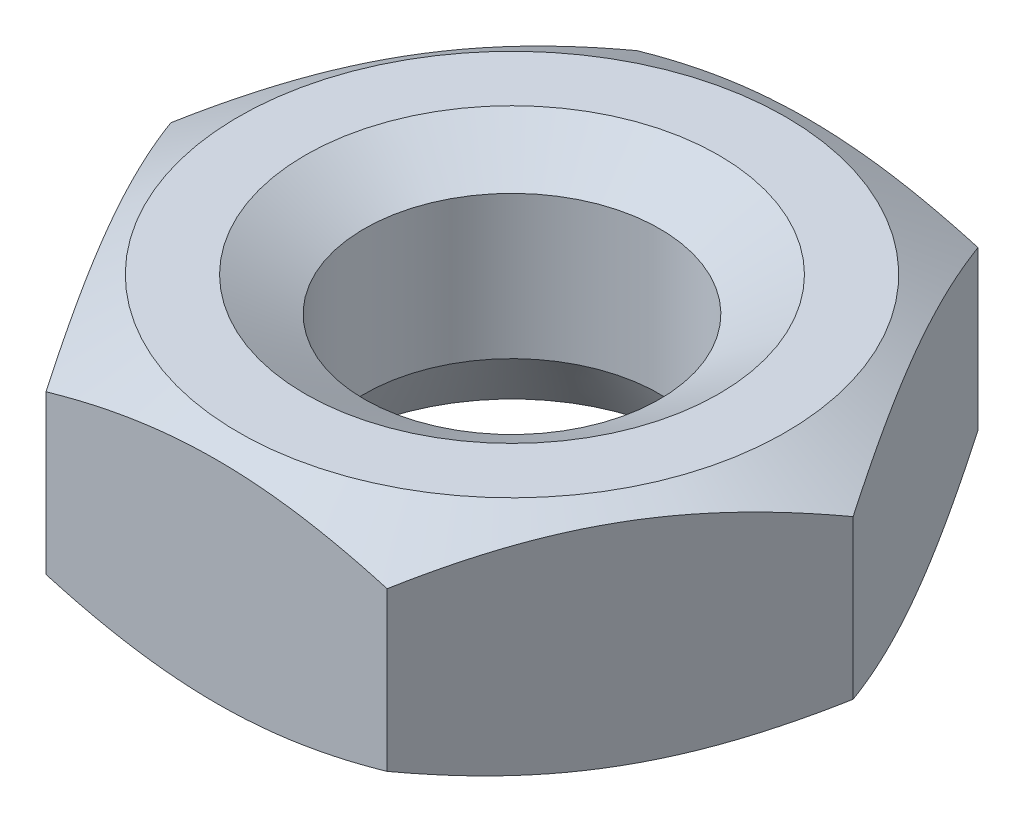
ISO-10303-21;
HEADER;
FILE_DESCRIPTION(('STEP AP214'),'2;1');
FILE_NAME('part.step','',(''),(''),'','','');
FILE_SCHEMA(('AUTOMOTIVE_DESIGN { 1 0 10303 214 1 1 1 1 }'));
ENDSEC;
DATA;
#1=APPLICATION_CONTEXT('core data for automotive mechanical design processes');
#2=APPLICATION_PROTOCOL_DEFINITION('international standard','automotive_design',2000,#1);
#3=PRODUCT_CONTEXT('',#1,'mechanical');
#4=PRODUCT('Part','Part','',(#3));
#5=PRODUCT_RELATED_PRODUCT_CATEGORY('part','',(#4));
#6=PRODUCT_DEFINITION_FORMATION('','',#4);
#7=PRODUCT_DEFINITION_CONTEXT('part definition',#1,'design');
#8=PRODUCT_DEFINITION('design','',#6,#7);
#9=PRODUCT_DEFINITION_SHAPE('','',#8);
#10=(LENGTH_UNIT() NAMED_UNIT(*) SI_UNIT(.MILLI.,.METRE.));
#11=(NAMED_UNIT(*) PLANE_ANGLE_UNIT() SI_UNIT($,.RADIAN.));
#12=(NAMED_UNIT(*) SI_UNIT($,.STERADIAN.) SOLID_ANGLE_UNIT());
#13=UNCERTAINTY_MEASURE_WITH_UNIT(LENGTH_MEASURE(1.E-05),#10,'distance_accuracy_value','');
#14=(GEOMETRIC_REPRESENTATION_CONTEXT(3) GLOBAL_UNCERTAINTY_ASSIGNED_CONTEXT((#13)) GLOBAL_UNIT_ASSIGNED_CONTEXT((#10,
#11,#12)) REPRESENTATION_CONTEXT('',''));
#15=CARTESIAN_POINT('',(0.,0.,0.));
#16=DIRECTION('',(0.,0.,1.));
#17=DIRECTION('',(1.,0.,0.));
#18=AXIS2_PLACEMENT_3D('',#15,#16,#17);
#19=CARTESIAN_POINT('',(-1.38777878078145E-12,4.,-1.08940634291343E-12));
#20=DIRECTION('',(0.,1.,0.));
#21=DIRECTION('',(0.,0.,0.999999999999889));
#22=AXIS2_PLACEMENT_3D('',#19,#20,#21);
#23=PLANE('',#22);
#24=CARTESIAN_POINT('',(-1.38777878078145E-12,4.,-1.08940634291343E-12));
#25=DIRECTION('',(0.,1.,0.));
#26=DIRECTION('',(0.,0.,0.999999999999889));
#27=AXIS2_PLACEMENT_3D('',#24,#25,#26);
#28=CIRCLE('',#27,3.50000000000001);
#29=CARTESIAN_POINT('',(-1.38700162466421E-12,4.,3.49999999999853));
#30=VERTEX_POINT('',#29);
#31=EDGE_CURVE('E108',#30,#30,#28,.F.);
#32=ORIENTED_EDGE('',*,*,#31,.T.);
#33=EDGE_LOOP('',(#32));
#34=FACE_BOUND('',#33,.T.);
#35=CARTESIAN_POINT('',(-1.38777878078145E-12,4.,-1.08940634291343E-12));
#36=DIRECTION('',(0.,-1.,0.));
#37=DIRECTION('',(0.,0.,-0.999999999999889));
#38=AXIS2_PLACEMENT_3D('',#35,#36,#37);
#39=CIRCLE('',#38,4.62815384012406);
#40=CARTESIAN_POINT('',(-1.38880643737241E-12,4.,-4.62815384012464));
#41=VERTEX_POINT('',#40);
#42=EDGE_CURVE('E117',#41,#41,#39,.T.);
#43=ORIENTED_EDGE('',*,*,#42,.F.);
#44=EDGE_LOOP('',(#43));
#45=FACE_BOUND('',#44,.T.);
#46=ADVANCED_FACE('F46',(#34,#45),#23,.T.);
#47=CARTESIAN_POINT('',(0.,0.,0.));
#48=DIRECTION('',(0.,1.,0.));
#49=DIRECTION('',(0.,0.,0.999999999999889));
#50=AXIS2_PLACEMENT_3D('',#47,#48,#49);
#51=PLANE('',#50);
#52=CARTESIAN_POINT('',(0.,0.,0.));
#53=DIRECTION('',(0.,1.,0.));
#54=DIRECTION('',(0.,0.,0.999999999999889));
#55=AXIS2_PLACEMENT_3D('',#52,#53,#54);
#56=CIRCLE('',#55,3.07735026918963);
#57=CARTESIAN_POINT('',(0.,0.,3.07735026918929));
#58=VERTEX_POINT('',#57);
#59=EDGE_CURVE('E136',#58,#58,#56,.T.);
#60=ORIENTED_EDGE('',*,*,#59,.T.);
#61=EDGE_LOOP('',(#60));
#62=FACE_BOUND('',#61,.T.);
#63=CARTESIAN_POINT('',(0.,0.,0.));
#64=DIRECTION('',(0.,-1.,0.));
#65=DIRECTION('',(0.,0.,-0.999999999999889));
#66=AXIS2_PLACEMENT_3D('',#63,#64,#65);
#67=CIRCLE('',#66,4.62815384012406);
#68=CARTESIAN_POINT('',(0.,0.,-4.62815384012355));
#69=VERTEX_POINT('',#68);
#70=EDGE_CURVE('E275',#69,#69,#67,.T.);
#71=ORIENTED_EDGE('',*,*,#70,.T.);
#72=EDGE_LOOP('',(#71));
#73=FACE_BOUND('',#72,.T.);
#74=ADVANCED_FACE('F157',(#62,#73),#51,.F.);
#75=CARTESIAN_POINT('',(-1.38777878078145E-12,4.,-1.08940634291343E-12));
#76=DIRECTION('',(0.,-1.,0.));
#77=DIRECTION('',(0.,0.,-0.999999999999889));
#78=AXIS2_PLACEMENT_3D('',#75,#76,#77);
#79=CYLINDRICAL_SURFACE('',#78,2.5);
#80=CARTESIAN_POINT('',(-1.94289029309402E-12,1.,-9.15933995315754E-13));
#81=DIRECTION('',(0.,1.,0.));
#82=DIRECTION('',(0.,0.,0.999999999999889));
#83=AXIS2_PLACEMENT_3D('',#80,#81,#82);
#84=CIRCLE('',#83,2.5);
#85=CARTESIAN_POINT('',(-1.94233518158171E-12,1.,2.49999999999881));
#86=VERTEX_POINT('',#85);
#87=EDGE_CURVE('E142',#86,#86,#84,.F.);
#88=ORIENTED_EDGE('',*,*,#87,.T.);
#89=EDGE_LOOP('',(#88));
#90=FACE_BOUND('',#89,.T.);
#91=CARTESIAN_POINT('',(-5.55111512312578E-13,3.42264973081038,-7.63278329429795E-13));
#92=DIRECTION('',(0.,1.,0.));
#93=DIRECTION('',(0.,0.,0.999999999999889));
#94=AXIS2_PLACEMENT_3D('',#91,#92,#93);
#95=CIRCLE('',#94,2.5);
#96=CARTESIAN_POINT('',(-5.54556400800266E-13,3.42264973081038,2.49999999999896));
#97=VERTEX_POINT('',#96);
#98=EDGE_CURVE('E139',#97,#97,#95,.T.);
#99=ORIENTED_EDGE('',*,*,#98,.T.);
#100=EDGE_LOOP('',(#99));
#101=FACE_BOUND('',#100,.T.);
#102=ADVANCED_FACE('F250',(#90,#101),#79,.F.);
#103=CARTESIAN_POINT('',(0.,0.,0.));
#104=DIRECTION('',(0.,-1.,0.));
#105=DIRECTION('',(0.,0.,-0.999999999999889));
#106=AXIS2_PLACEMENT_3D('',#103,#104,#105);
#107=CONICAL_SURFACE('',#106,3.07735026918963,0.523598775598296);
#108=ORIENTED_EDGE('',*,*,#87,.F.);
#109=EDGE_LOOP('',(#108));
#110=FACE_BOUND('',#109,.T.);
#111=ORIENTED_EDGE('',*,*,#59,.F.);
#112=EDGE_LOOP('',(#111));
#113=FACE_BOUND('',#112,.T.);
#114=ADVANCED_FACE('F254',(#110,#113),#107,.F.);
#115=CARTESIAN_POINT('',(-5.55111512312578E-13,3.42264973081038,-7.63278329429795E-13));
#116=DIRECTION('',(0.,1.,0.));
#117=DIRECTION('',(0.,0.,0.999999999999889));
#118=AXIS2_PLACEMENT_3D('',#115,#116,#117);
#119=CONICAL_SURFACE('',#118,2.5,1.0471975511966);
#120=ORIENTED_EDGE('',*,*,#31,.F.);
#121=EDGE_LOOP('',(#120));
#122=FACE_BOUND('',#121,.T.);
#123=ORIENTED_EDGE('',*,*,#98,.F.);
#124=EDGE_LOOP('',(#123));
#125=FACE_BOUND('',#124,.T.);
#126=ADVANCED_FACE('F48',(#122,#125),#119,.F.);
#127=CARTESIAN_POINT('',(-2.19269047363468E-12,1.15470053837927,-7.35522753814166E-13));
#128=DIRECTION('',(0.,1.,0.));
#129=DIRECTION('',(0.,0.,0.999999999999889));
#130=AXIS2_PLACEMENT_3D('',#127,#128,#129);
#131=CONICAL_SURFACE('',#130,6.62815384012406,1.0471975511966);
#132=ORIENTED_EDGE('',*,*,#70,.F.);
#133=EDGE_LOOP('',(#132));
#134=FACE_BOUND('',#133,.T.);
#135=CARTESIAN_POINT('',(-7.69482048381559,2.62605525680543,-5.00000000000059));
#136=CARTESIAN_POINT('',(-7.47692178898118,2.5205949039547,-5.00000000000078));
#137=CARTESIAN_POINT('',(-7.25851644855394,2.41616310640609,-5.00000000000086));
#138=CARTESIAN_POINT('',(-6.82042280031742,2.20993635827881,-5.00000000000092));
#139=CARTESIAN_POINT('',(-6.600734291363,2.10814183548716,-5.0000000000009));
#140=CARTESIAN_POINT('',(-6.15864403241378,1.90724449766301,-5.00000000000088));
#141=CARTESIAN_POINT('',(-5.93623398201398,1.80815988404629,-5.00000000000089));
#142=CARTESIAN_POINT('',(-5.48962390294766,1.61412590509814,-5.00000000000089));
#143=CARTESIAN_POINT('',(-5.26542396128256,1.51917634020474,-5.00000000000089));
#144=CARTESIAN_POINT('',(-4.80788711640357,1.33164100145895,-5.00000000000089));
#145=CARTESIAN_POINT('',(-4.57448241074212,1.23921972951655,-5.00000000000088));
#146=CARTESIAN_POINT('',(-4.10492047143994,1.06151684862578,-5.0000000000009));
#147=CARTESIAN_POINT('',(-3.86876292918274,0.976236049127812,-5.00000000000094));
#148=CARTESIAN_POINT('',(-3.39378119963367,0.815096396793643,-5.00000000000085));
#149=CARTESIAN_POINT('',(-3.15496372879617,0.73921794831878,-5.00000000000073));
#150=CARTESIAN_POINT('',(-2.67390407431512,0.599356854411714,-5.00000000000106));
#151=CARTESIAN_POINT('',(-2.43166301441282,0.535370398906047,-5.0000000000015));
#152=CARTESIAN_POINT('',(-1.94494449980316,0.42273797955071,-5.0000000000015));
#153=CARTESIAN_POINT('',(-1.70048602320026,0.374011533375519,-5.00000000000105));
#154=CARTESIAN_POINT('',(-1.20859244914443,0.294696816592597,-5.00000000000073));
#155=CARTESIAN_POINT('',(-0.961157618355982,0.264106933220523,-5.00000000000085));
#156=CARTESIAN_POINT('',(-0.467754247369993,0.223907235600047,-5.00000000000093));
#157=CARTESIAN_POINT('',(-0.221807845740782,0.214032370130144,-5.00000000000089));
#158=CARTESIAN_POINT('',(0.27004431521417,0.215405758220579,-5.0000000000009));
#159=CARTESIAN_POINT('',(0.515950073281011,0.226654575153512,-5.00000000000095));
#160=CARTESIAN_POINT('',(0.93519903279795,0.263053448954148,-5.00000000000094));
#161=CARTESIAN_POINT('',(1.10899674076222,0.283253058443015,-5.00000000000091));
#162=CARTESIAN_POINT('',(1.45527310183483,0.33291385616725,-5.00000000000088));
#163=CARTESIAN_POINT('',(1.62775156488399,0.362376354059045,-5.00000000000089));
#164=CARTESIAN_POINT('',(2.14300411860366,0.463104604953298,-5.0000000000009));
#165=CARTESIAN_POINT('',(2.48339386009702,0.546691344461461,-5.00000000000088));
#166=CARTESIAN_POINT('',(2.99231305659809,0.691040823189024,-5.0000000000009));
#167=CARTESIAN_POINT('',(3.1634948887911,0.742979727025531,-5.00000000000091));
#168=CARTESIAN_POINT('',(3.50419455362874,0.852102774743561,-5.00000000000087));
#169=CARTESIAN_POINT('',(3.67371237543184,0.909286952774608,-5.00000000000083));
#170=CARTESIAN_POINT('',(4.01114087366597,1.02799531452346,-5.00000000000096));
#171=CARTESIAN_POINT('',(4.17905209160298,1.08951797290796,-5.00000000000114));
#172=CARTESIAN_POINT('',(4.51349322907284,1.21619439376583,-5.00000000000064));
#173=CARTESIAN_POINT('',(4.68002316342885,1.28134811721454,-4.99999999999996));
#174=CARTESIAN_POINT('',(5.06750676296458,1.43704097546944,-4.9999999999997));
#175=CARTESIAN_POINT('',(5.28798308342898,1.52876580115425,-5.00000000000057));
#176=CARTESIAN_POINT('',(5.72711612792135,1.71648371531803,-5.00000000000121));
#177=CARTESIAN_POINT('',(5.94577275146496,1.81247703767259,-5.00000000000098));
#178=CARTESIAN_POINT('',(6.3815955760152,2.0078881216854,-5.00000000000081));
#179=CARTESIAN_POINT('',(6.5987614911686,2.10730651927501,-5.00000000000087));
#180=CARTESIAN_POINT('',(7.03181242191538,2.30889892300167,-5.00000000000092));
#181=CARTESIAN_POINT('',(7.24769741182052,2.41107298417569,-5.0000000000009));
#182=CARTESIAN_POINT('',(7.89414820212317,2.72112981964648,-5.00000000000088));
#183=CARTESIAN_POINT('',(8.32310576613957,2.93236363931599,-5.00000000000089));
#184=CARTESIAN_POINT('',(9.17797227666944,3.36091173886648,-5.0000000000009));
#185=CARTESIAN_POINT('',(9.60388111621087,3.57822623080227,-5.00000000000089));
#186=CARTESIAN_POINT('',(10.2237189384629,3.89849802474397,-5.00000000000089));
#187=CARTESIAN_POINT('',(10.4185361721616,3.99974121205025,-5.0000000000009));
#188=CARTESIAN_POINT('',(10.8077504288001,4.20302390795568,-5.00000000000089));
#189=CARTESIAN_POINT('',(11.0021474590474,4.30506340256231,-5.00000000000089));
#190=CARTESIAN_POINT('',(11.5848085140393,4.61222442973064,-5.00000000000091));
#191=CARTESIAN_POINT('',(11.9725271753062,4.8183805639251,-5.00000000000096));
#192=CARTESIAN_POINT('',(12.7459256784422,5.23231271816532,-5.00000000000083));
#193=CARTESIAN_POINT('',(13.1316081700668,5.44008379648624,-5.00000000000065));
#194=CARTESIAN_POINT('',(13.9020491582954,5.85728509106958,-5.00000000000114));
#195=CARTESIAN_POINT('',(14.2868077019825,6.0667152203466,-5.00000000000181));
#196=CARTESIAN_POINT('',(14.6712244626912,6.27676696784799,-5.00000000000344));
#197=B_SPLINE_CURVE_WITH_KNOTS('',3,(#135,#136,#137,#138,#139,#140,#141,#142,#143,#144,#145,
#146,#147,#148,#149,#150,#151,#152,#153,#154,#155,#156,#157,#158,#159,#160,#161,#162,#163,#164,
#165,#166,#167,#168,#169,#170,#171,#172,#173,#174,#175,#176,#177,#178,#179,#180,#181,#182,#183,
#184,#185,#186,#187,#188,#189,#190,#191,#192,#193,#194,#195,#196),.UNSPECIFIED.,.F.,.F.,(4,2,2,
2,2,2,2,2,2,2,2,2,2,2,2,2,2,2,2,2,2,2,2,2,2,2,2,2,2,2,4),(0.,0.726242979725138,1.4526030335093,
2.18301848589337,2.91339864847779,3.66641863575841,4.41952387081589,5.17103215722703,
5.92229925139039,6.66953465307714,7.41670359810168,8.15425261039117,8.89182129353129,
9.41646848921312,9.94118989682286,10.9912374160188,11.5278575569248,12.064481191761,
12.6009170908705,13.13734722578,13.8536734148898,14.5700389007724,15.2865381182612,
16.0030516565096,17.4374098836948,18.8718181945861,19.5304785440241,20.1891273455748,
21.5064767362396,22.8207321391683,24.1349190847641),.UNSPECIFIED.);
#198=CARTESIAN_POINT('',(2.88675134594588,0.661267467886722,-5.0000000000019));
#199=VERTEX_POINT('',#198);
#200=CARTESIAN_POINT('',(-2.88675134595001,0.661267467886722,-5.0000000000012));
#201=VERTEX_POINT('',#200);
#202=EDGE_CURVE('E59',#199,#201,#197,.F.);
#203=ORIENTED_EDGE('',*,*,#202,.F.);
#204=CARTESIAN_POINT('',(5.77361816194735,0.661334136553338,0.000199999998728995));
#205=CARTESIAN_POINT('',(5.64675433464814,0.588072048139229,-0.219534594526576));
#206=CARTESIAN_POINT('',(5.51880543790339,0.521436802419576,-0.441148584461043));
#207=CARTESIAN_POINT('',(5.26069210252081,0.405124471512175,-0.888213995454882));
#208=CARTESIAN_POINT('',(5.13052307794491,0.355488530417129,-1.11367335959197));
#209=CARTESIAN_POINT('',(4.87177839004419,0.278236505920419,-1.56183230522454));
#210=CARTESIAN_POINT('',(4.74324302208165,0.250105858785618,-1.78446209310523));
#211=CARTESIAN_POINT('',(4.54998783159893,0.224880402454975,-2.11918990184772));
#212=CARTESIAN_POINT('',(4.48552534904902,0.219298940270255,-2.23084219680619));
#213=CARTESIAN_POINT('',(4.35654081066678,0.213887697253863,-2.45424997067502));
#214=CARTESIAN_POINT('',(4.29201875673612,0.214057738762738,-2.5660054462916));
#215=CARTESIAN_POINT('',(4.11524635304998,0.222439112298356,-2.87218423085203));
#216=CARTESIAN_POINT('',(4.00305457768896,0.236515252400173,-3.06650608596874));
#217=CARTESIAN_POINT('',(3.77941563226209,0.281150737609861,-3.45386010199925));
#218=CARTESIAN_POINT('',(3.66796924828176,0.311725340648843,-3.64689090137301));
#219=CARTESIAN_POINT('',(3.44387972422916,0.38815397412321,-4.03502534247599));
#220=CARTESIAN_POINT('',(3.33126486598461,0.434331859380498,-4.23007999864267));
#221=CARTESIAN_POINT('',(3.10771464157741,0.539137274993313,-4.6172803453595));
#222=CARTESIAN_POINT('',(2.99677641204659,0.597740183938552,-4.80943099540882));
#223=CARTESIAN_POINT('',(2.88663587589263,0.661334136553365,-5.00020000000077));
#224=B_SPLINE_CURVE_WITH_KNOTS('',3,(#204,#205,#206,#207,#208,#209,#210,#211,#212,#213,#214,
#215,#216,#217,#218,#219,#220,#221,#222,#223),.UNSPECIFIED.,.F.,.F.,(4,2,2,2,2,2,2,2,2,4),(0.,
0.792555841363197,1.58701660053287,2.36181537487235,2.74884076077292,3.1358541917729,
3.80962362599673,4.48401723901158,5.17336882348829,5.86136694793605),.UNSPECIFIED.);
#225=CARTESIAN_POINT('',(5.77350269189286,0.661267467886722,-2.05391259555654E-12));
#226=VERTEX_POINT('',#225);
#227=EDGE_CURVE('E102',#226,#199,#224,.T.);
#228=ORIENTED_EDGE('',*,*,#227,.F.);
#229=CARTESIAN_POINT('',(2.88663587589161,0.66133413655331,5.00019999999879));
#230=CARTESIAN_POINT('',(3.01349970319143,0.588072048139063,4.7804654054737));
#231=CARTESIAN_POINT('',(3.14144859993644,0.521436802419487,4.55885141553927));
#232=CARTESIAN_POINT('',(3.3995619353194,0.405124471512166,4.11178600454515));
#233=CARTESIAN_POINT('',(3.5297309598954,0.355488530417138,3.88632664040774));
#234=CARTESIAN_POINT('',(3.78847564779633,0.278236505920055,3.43816769477476));
#235=CARTESIAN_POINT('',(3.91701101575897,0.250105858784859,3.21553790689397));
#236=CARTESIAN_POINT('',(4.11026620624174,0.224880402455113,2.88081009815133));
#237=CARTESIAN_POINT('',(4.17472868879163,0.219298940270939,2.76915780319284));
#238=CARTESIAN_POINT('',(4.30371322717394,0.213887697252949,2.54575002932403));
#239=CARTESIAN_POINT('',(4.36823528110469,0.214057738759679,2.43399455370752));
#240=CARTESIAN_POINT('',(4.5450076847908,0.222439112293561,2.12781576914732));
#241=CARTESIAN_POINT('',(4.65719946015154,0.236515252398853,1.93349391403078));
#242=CARTESIAN_POINT('',(4.88083840557813,0.281150737611103,1.54613989800046));
#243=CARTESIAN_POINT('',(4.99228478955847,0.311725340649175,1.35310909862674));
#244=CARTESIAN_POINT('',(5.21637431361117,0.388153974122811,0.964974657523775));
#245=CARTESIAN_POINT('',(5.32898917185582,0.434331859380314,0.769920001357076));
#246=CARTESIAN_POINT('',(5.55253939626278,0.539137274993523,0.382719654640135));
#247=CARTESIAN_POINT('',(5.66347762579326,0.59774018393893,0.190569004590727));
#248=CARTESIAN_POINT('',(5.77361816194649,0.661334136553338,-0.000200000001567002));
#249=B_SPLINE_CURVE_WITH_KNOTS('',3,(#229,#230,#231,#232,#233,#234,#235,#236,#237,#238,#239,
#240,#241,#242,#243,#244,#245,#246,#247,#248),.UNSPECIFIED.,.F.,.F.,(4,2,2,2,2,2,2,2,2,4),(0.,
0.792555841363508,1.58701660053418,2.36181537487405,2.74884076077469,3.13585419177458,
3.80962362599799,4.48401723901265,5.17336882348959,5.8613669479371),.UNSPECIFIED.);
#250=CARTESIAN_POINT('',(2.8867513459459,0.661267467886695,4.99999999999719));
#251=VERTEX_POINT('',#250);
#252=EDGE_CURVE('E116',#251,#226,#249,.T.);
#253=ORIENTED_EDGE('',*,*,#252,.F.);
#254=CARTESIAN_POINT('',(-7.69482048381606,2.6260552568054,4.99999999999898));
#255=CARTESIAN_POINT('',(-7.47692178898171,2.52059490395481,4.9999999999991));
#256=CARTESIAN_POINT('',(-7.25851644855455,2.41616310640628,4.99999999999915));
#257=CARTESIAN_POINT('',(-6.82042280031822,2.20993635827912,4.99999999999919));
#258=CARTESIAN_POINT('',(-6.6007342913639,2.1081418354875,4.99999999999918));
#259=CARTESIAN_POINT('',(-6.15864403241485,1.90724449766339,4.99999999999917));
#260=CARTESIAN_POINT('',(-5.93623398201512,1.8081598840467,4.99999999999917));
#261=CARTESIAN_POINT('',(-5.48962390294892,1.61412590509858,4.99999999999917));
#262=CARTESIAN_POINT('',(-5.26542396128389,1.51917634020519,4.99999999999916));
#263=CARTESIAN_POINT('',(-4.80788711640482,1.33164100145934,4.99999999999917));
#264=CARTESIAN_POINT('',(-4.57448241074324,1.23921972951687,4.9999999999992));
#265=CARTESIAN_POINT('',(-4.10492047144078,1.06151684862598,4.99999999999914));
#266=CARTESIAN_POINT('',(-3.86876292918344,0.976236049127949,4.99999999999906));
#267=CARTESIAN_POINT('',(-3.39378119963412,0.815096396793657,4.99999999999928));
#268=CARTESIAN_POINT('',(-3.15496372879652,0.739217948318728,4.99999999999958));
#269=CARTESIAN_POINT('',(-2.67390407431523,0.599356854411644,4.99999999999875));
#270=CARTESIAN_POINT('',(-2.4316630144128,0.535370398906024,4.99999999999763));
#271=CARTESIAN_POINT('',(-1.94494449980302,0.422737979550704,4.99999999999766));
#272=CARTESIAN_POINT('',(-1.70048602320015,0.374011533375474,4.99999999999882));
#273=CARTESIAN_POINT('',(-1.20859244914428,0.294696816592313,4.9999999999995));
#274=CARTESIAN_POINT('',(-0.96115761835576,0.26410693322004,4.99999999999903));
#275=CARTESIAN_POINT('',(-0.467754247369797,0.223907235600196,4.99999999999929));
#276=CARTESIAN_POINT('',(-0.221807845740683,0.214032370131103,4.99999999999999));
#277=CARTESIAN_POINT('',(0.270044315214256,0.21540575821932,4.99999999999833));
#278=CARTESIAN_POINT('',(0.515950073281182,0.226654575149217,4.99999999999595));
#279=CARTESIAN_POINT('',(0.935199032797741,0.263053448950839,4.99999999999674));
#280=CARTESIAN_POINT('',(1.1089967407617,0.283253058441943,4.9999999999985));
#281=CARTESIAN_POINT('',(1.45527310183406,0.332913856167844,4.99999999999982));
#282=CARTESIAN_POINT('',(1.62775156488327,0.36237635405907,4.99999999999938));
#283=CARTESIAN_POINT('',(2.14300411860312,0.463104604952433,4.9999999999987));
#284=CARTESIAN_POINT('',(2.48339386009652,0.546691344461083,4.99999999999908));
#285=CARTESIAN_POINT('',(2.99231305659776,0.69104082318885,4.99999999999919));
#286=CARTESIAN_POINT('',(3.16349488879088,0.742979727025344,4.99999999999915));
#287=CARTESIAN_POINT('',(3.50419455362875,0.852102774743422,4.99999999999915));
#288=CARTESIAN_POINT('',(3.67371237543196,0.909286952774528,4.9999999999992));
#289=CARTESIAN_POINT('',(4.01114087366629,1.02799531452345,4.99999999999911));
#290=CARTESIAN_POINT('',(4.17905209160339,1.08951797290796,4.99999999999899));
#291=CARTESIAN_POINT('',(4.51349322907336,1.21619439376594,4.99999999999932));
#292=CARTESIAN_POINT('',(4.6800231634294,1.28134811721477,4.99999999999977));
#293=CARTESIAN_POINT('',(5.06750676296525,1.43704097546977,4.99999999999994));
#294=CARTESIAN_POINT('',(5.28798308342977,1.52876580115451,4.99999999999936));
#295=CARTESIAN_POINT('',(5.72711612792229,1.71648371531829,4.99999999999894));
#296=CARTESIAN_POINT('',(5.94577275146596,1.81247703767292,4.99999999999909));
#297=CARTESIAN_POINT('',(6.38159557601633,2.00788812168582,4.99999999999921));
#298=CARTESIAN_POINT('',(6.59876149116979,2.10730651927547,4.99999999999917));
#299=CARTESIAN_POINT('',(7.03181242191671,2.3088989230022,4.99999999999913));
#300=CARTESIAN_POINT('',(7.24769741182191,2.41107298417626,4.99999999999914));
#301=CARTESIAN_POINT('',(7.89414820212482,2.7211298196472,4.99999999999916));
#302=CARTESIAN_POINT('',(8.32310576614141,2.93236363931682,4.99999999999915));
#303=CARTESIAN_POINT('',(9.17797227667166,3.36091173886753,4.99999999999914));
#304=CARTESIAN_POINT('',(9.60388111621328,3.57822623080343,4.99999999999915));
#305=CARTESIAN_POINT('',(10.2237189384654,3.89849802474519,4.99999999999914));
#306=CARTESIAN_POINT('',(10.418536172164,3.99974121205141,4.99999999999914));
#307=CARTESIAN_POINT('',(10.8077504288023,4.20302390795673,4.99999999999915));
#308=CARTESIAN_POINT('',(11.0021474590494,4.3050634025633,4.99999999999916));
#309=CARTESIAN_POINT('',(11.5848085140409,4.61222442973146,4.99999999999911));
#310=CARTESIAN_POINT('',(11.9725271753076,4.81838056392581,4.99999999999899));
#311=CARTESIAN_POINT('',(12.7459256784431,5.23231271816573,4.99999999999929));
#312=CARTESIAN_POINT('',(13.1316081700674,5.44008379648649,4.99999999999971));
#313=CARTESIAN_POINT('',(13.9020491582954,5.85728509106958,4.99999999999856));
#314=CARTESIAN_POINT('',(14.2868077019822,6.06671522034652,4.99999999999699));
#315=CARTESIAN_POINT('',(14.6712244626905,6.27676696784796,4.99999999999314));
#316=B_SPLINE_CURVE_WITH_KNOTS('',3,(#254,#255,#256,#257,#258,#259,#260,#261,#262,#263,#264,
#265,#266,#267,#268,#269,#270,#271,#272,#273,#274,#275,#276,#277,#278,#279,#280,#281,#282,#283,
#284,#285,#286,#287,#288,#289,#290,#291,#292,#293,#294,#295,#296,#297,#298,#299,#300,#301,#302,
#303,#304,#305,#306,#307,#308,#309,#310,#311,#312,#313,#314,#315),.UNSPECIFIED.,.F.,.F.,(4,2,2,
2,2,2,2,2,2,2,2,2,2,2,2,2,2,2,2,2,2,2,2,2,2,2,2,2,2,2,4),(0.,0.726242979724813,1.45260303350864,
2.18301848589251,2.91339864847675,3.66641863575783,4.41952387081577,5.17103215722726,
5.92229925139096,6.66953465307771,7.41670359810239,8.15425261039176,8.89182129353154,
9.41646848921314,9.94118989682287,10.9912374160191,11.5278575569253,12.064481191762,
12.6009170908717,13.1373472257814,13.8536734148915,14.5700389007743,15.2865381182633,
16.003051656512,17.4374098836978,18.8718181945898,19.5304785440274,20.1891273455777,
21.5064767362417,22.8207321391695,24.1349190847643),.UNSPECIFIED.);
#317=CARTESIAN_POINT('',(-2.8867513459504,0.661267467886695,4.99999999999753));
#318=VERTEX_POINT('',#317);
#319=EDGE_CURVE('E225',#318,#251,#316,.T.);
#320=ORIENTED_EDGE('',*,*,#319,.F.);
#321=CARTESIAN_POINT('',(-5.77361816195199,0.661334136553338,-0.000200000001761291));
#322=CARTESIAN_POINT('',(-5.64675433465245,0.588072048138728,0.219534594523245));
#323=CARTESIAN_POINT('',(-5.51880543790759,0.52143680241918,0.441148584457553));
#324=CARTESIAN_POINT('',(-5.26069210252474,0.40512447151193,0.888213995451607));
#325=CARTESIAN_POINT('',(-5.13052307794867,0.355488530416961,1.11367335958908));
#326=CARTESIAN_POINT('',(-4.87177839004777,0.278236505919433,1.56183230522201));
#327=CARTESIAN_POINT('',(-4.74324302208522,0.25010585878373,1.78446209310267));
#328=CARTESIAN_POINT('',(-4.54998783160257,0.224880402454915,2.11918990184507));
#329=CARTESIAN_POINT('',(-4.48552534905273,0.219298940271332,2.23084219680345));
#330=CARTESIAN_POINT('',(-4.3565408106706,0.213887697251396,2.45424997067203));
#331=CARTESIAN_POINT('',(-4.29201875673998,0.214057738755588,2.56600544628844));
#332=CARTESIAN_POINT('',(-4.11524635305401,0.222439112287304,2.87218423084851));
#333=CARTESIAN_POINT('',(-4.00305457769324,0.236515252396543,3.06650608596491));
#334=CARTESIAN_POINT('',(-3.77941563226653,0.281150737611668,3.45386010199526));
#335=CARTESIAN_POINT('',(-3.66796924828611,0.311725340648668,3.64689090136916));
#336=CARTESIAN_POINT('',(-3.4438797242332,0.3881539741214,4.03502534247261));
#337=CARTESIAN_POINT('',(-3.33126486598843,0.434331859379109,4.23007999863963));
#338=CARTESIAN_POINT('',(-3.10771464158111,0.539137274992983,4.61728034535684));
#339=CARTESIAN_POINT('',(-2.99677641205038,0.59774018393884,4.80943099540621));
#340=CARTESIAN_POINT('',(-2.88663587589666,0.661334136553338,5.00019999999827));
#341=B_SPLINE_CURVE_WITH_KNOTS('',3,(#321,#322,#323,#324,#325,#326,#327,#328,#329,#330,#331,
#332,#333,#334,#335,#336,#337,#338,#339,#340),.UNSPECIFIED.,.F.,.F.,(4,2,2,2,2,2,2,2,2,4),(0.,
0.79255584136302,1.58701660053396,2.36181537487339,2.74884076077369,3.13585419177304,
3.80962362599661,4.48401723901171,5.17336882348964,5.86136694793761),.UNSPECIFIED.);
#342=CARTESIAN_POINT('',(-5.77350269189833,0.661267467886722,-1.99840144432528E-12));
#343=VERTEX_POINT('',#342);
#344=EDGE_CURVE('E219',#343,#318,#341,.T.);
#345=ORIENTED_EDGE('',*,*,#344,.F.);
#346=CARTESIAN_POINT('',(-2.8866358758961,0.661334136553365,-5.00020000000025));
#347=CARTESIAN_POINT('',(-3.01349970319486,0.588072048138706,-4.78046540547493));
#348=CARTESIAN_POINT('',(-3.14144859993938,0.521436802418931,-4.55885141554051));
#349=CARTESIAN_POINT('',(-3.39956193532181,0.405124471511458,-4.11178600454669));
#350=CARTESIAN_POINT('',(-3.52973095989777,0.355488530416473,-3.88632664040957));
#351=CARTESIAN_POINT('',(-3.7884756477985,0.278236505919488,-3.43816769477708));
#352=CARTESIAN_POINT('',(-3.91701101576098,0.250105858784349,-3.2155379068965));
#353=CARTESIAN_POINT('',(-4.11026620624356,0.224880402454276,-2.88081009815416));
#354=CARTESIAN_POINT('',(-4.1747286887934,0.219298940269925,-2.76915780319576));
#355=CARTESIAN_POINT('',(-4.30371322717561,0.213887697252302,-2.54575002932713));
#356=CARTESIAN_POINT('',(-4.3682352811063,0.214057738759577,-2.4339945537107));
#357=CARTESIAN_POINT('',(-4.54500768479246,0.222439112293824,-2.12781576915035));
#358=CARTESIAN_POINT('',(-4.65719946015334,0.236515252398122,-1.93349391403357));
#359=CARTESIAN_POINT('',(-4.88083840558022,0.281150737609636,-1.54613989800288));
#360=CARTESIAN_POINT('',(-4.9922847895607,0.311725340647963,-1.35310909862902));
#361=CARTESIAN_POINT('',(-5.21637431361344,0.388153974121777,-0.964974657525609));
#362=CARTESIAN_POINT('',(-5.32898917185798,0.434331859379194,-0.769920001358595));
#363=CARTESIAN_POINT('',(-5.55253939626574,0.539137274992554,-0.382719654641664));
#364=CARTESIAN_POINT('',(-5.66347762579716,0.597740183938202,-0.190569004592579));
#365=CARTESIAN_POINT('',(-5.77361816195246,0.661334136553338,0.000199999998617972));
#366=B_SPLINE_CURVE_WITH_KNOTS('',3,(#346,#347,#348,#349,#350,#351,#352,#353,#354,#355,#356,
#357,#358,#359,#360,#361,#362,#363,#364,#365),.UNSPECIFIED.,.F.,.F.,(4,2,2,2,2,2,2,2,2,4),(0.,
0.792555841362894,1.58701660053273,2.36181537487187,2.74884076077219,3.1358541917718,
3.80962362599589,4.48401723901117,5.1733688234887,5.86136694793696),.UNSPECIFIED.);
#367=EDGE_CURVE('E73',#201,#343,#366,.T.);
#368=ORIENTED_EDGE('',*,*,#367,.F.);
#369=EDGE_LOOP('',(#203,#228,#253,#320,#345,#368));
#370=FACE_BOUND('',#369,.T.);
#371=ADVANCED_FACE('F101',(#134,#370),#131,.T.);
#372=CARTESIAN_POINT('',(-1.38777878078145E-12,4.,-1.08940634291343E-12));
#373=DIRECTION('',(0.,-1.,0.));
#374=DIRECTION('',(0.,0.,-0.999999999999889));
#375=AXIS2_PLACEMENT_3D('',#372,#373,#374);
#376=CONICAL_SURFACE('',#375,4.62815384012406,1.0471975511966);
#377=ORIENTED_EDGE('',*,*,#42,.T.);
#378=EDGE_LOOP('',(#377));
#379=FACE_BOUND('',#378,.T.);
#380=CARTESIAN_POINT('',(-2.88663587589599,3.33866586344667,5.00019999999889));
#381=CARTESIAN_POINT('',(-3.01349970319503,3.4119279518611,4.78046540547364));
#382=CARTESIAN_POINT('',(-3.14144859993969,3.47856319758058,4.55885141553927));
#383=CARTESIAN_POINT('',(-3.39956193532236,3.59487552848774,4.11178600454529));
#384=CARTESIAN_POINT('',(-3.52973095989843,3.6445114695827,3.88632664040794));
#385=CARTESIAN_POINT('',(-3.78847564779924,3.72176349408011,3.43816769477514));
#386=CARTESIAN_POINT('',(-3.91701101576169,3.7498941412157,3.21553790689448));
#387=CARTESIAN_POINT('',(-4.11026620624443,3.77511959754467,2.88081009815222));
#388=CARTESIAN_POINT('',(-4.17472868879434,3.78070105972835,2.7691578031939));
#389=CARTESIAN_POINT('',(-4.30371322717621,3.78611230274795,2.54575002932521));
#390=CARTESIAN_POINT('',(-4.36823528110649,3.78594226124333,2.43399455370862));
#391=CARTESIAN_POINT('',(-4.54500768479222,3.77756088771125,2.12781576914834));
#392=CARTESIAN_POINT('',(-4.65719946015357,3.76348474760269,1.93349391403216));
#393=CARTESIAN_POINT('',(-4.88083840558074,3.71884926238806,1.54613989800192));
#394=CARTESIAN_POINT('',(-4.99228478956104,3.68827465935087,1.35310909862791));
#395=CARTESIAN_POINT('',(-5.21637431361385,3.61184602587793,0.96497465752434));
#396=CARTESIAN_POINT('',(-5.32898917185864,3.56566814062021,0.769920001357329));
#397=CARTESIAN_POINT('',(-5.5525393962661,3.46086272500651,0.382719654640095));
#398=CARTESIAN_POINT('',(-5.66347762579696,3.40225981606085,0.190569004590703));
#399=CARTESIAN_POINT('',(-5.77361816195082,3.33866586344667,-0.000200000001428224));
#400=B_SPLINE_CURVE_WITH_KNOTS('',3,(#380,#381,#382,#383,#384,#385,#386,#387,#388,#389,#390,
#391,#392,#393,#394,#395,#396,#397,#398,#399),.UNSPECIFIED.,.F.,.F.,(4,2,2,2,2,2,2,2,2,4),(0.,
0.792555841362814,1.58701660053343,2.3618153748727,2.74884076077293,3.13585419177226,
3.80962362599602,4.48401723901127,5.17336882348924,5.86136694793733),.UNSPECIFIED.);
#401=CARTESIAN_POINT('',(-2.88675134594843,3.33873253211328,4.99999999999983));
#402=VERTEX_POINT('',#401);
#403=CARTESIAN_POINT('',(-5.77350269189664,3.33873253211328,1.11022302462516E-13));
#404=VERTEX_POINT('',#403);
#405=EDGE_CURVE('E201',#402,#404,#400,.T.);
#406=ORIENTED_EDGE('',*,*,#405,.F.);
#407=CARTESIAN_POINT('',(-7.69482048381737,1.3739447431946,5.00000000000019));
#408=CARTESIAN_POINT('',(-7.47692178898271,1.47940509604463,4.99999999999954));
#409=CARTESIAN_POINT('',(-7.25851644855541,1.58383689359294,4.99999999999927));
#410=CARTESIAN_POINT('',(-6.82042280031893,1.79006364171996,4.99999999999907));
#411=CARTESIAN_POINT('',(-6.60073429136462,1.89185816451166,4.99999999999914));
#412=CARTESIAN_POINT('',(-6.15864403241551,2.09275550233587,4.9999999999992));
#413=CARTESIAN_POINT('',(-5.93623398201572,2.19184011595257,4.99999999999918));
#414=CARTESIAN_POINT('',(-5.48962390294942,2.38587409490073,4.99999999999916));
#415=CARTESIAN_POINT('',(-5.26542396128435,2.48082365979415,4.99999999999917));
#416=CARTESIAN_POINT('',(-4.8078871164052,2.66835899854005,4.99999999999917));
#417=CARTESIAN_POINT('',(-4.57448241074358,2.76078027048254,4.99999999999917));
#418=CARTESIAN_POINT('',(-4.10492047144105,2.93848315137349,4.99999999999917));
#419=CARTESIAN_POINT('',(-3.86876292918367,3.02376395087157,4.99999999999917));
#420=CARTESIAN_POINT('',(-3.39378119963428,3.18490360320585,4.99999999999916));
#421=CARTESIAN_POINT('',(-3.15496372879663,3.26078205168073,4.99999999999915));
#422=CARTESIAN_POINT('',(-2.67390407431534,3.40064314558805,4.99999999999918));
#423=CARTESIAN_POINT('',(-2.43166301441295,3.46462960109396,4.99999999999921));
#424=CARTESIAN_POINT('',(-1.94494449980319,3.57726202044931,4.99999999999923));
#425=CARTESIAN_POINT('',(-1.70048602320029,3.62598846662427,4.9999999999992));
#426=CARTESIAN_POINT('',(-1.20859244914442,3.70530318340727,4.99999999999912));
#427=CARTESIAN_POINT('',(-0.961157618355933,3.73589306677965,4.99999999999907));
#428=CARTESIAN_POINT('',(-0.467754247370012,3.77609276439958,4.99999999999925));
#429=CARTESIAN_POINT('',(-0.221807845740907,3.78596762986866,4.9999999999995));
#430=CARTESIAN_POINT('',(0.270044315214011,3.78459424178055,4.99999999999882));
#431=CARTESIAN_POINT('',(0.515950073280924,3.77334542485077,4.99999999999791));
#432=CARTESIAN_POINT('',(0.935199032797519,3.73694655104917,4.99999999999822));
#433=CARTESIAN_POINT('',(1.10899674076153,3.71674694155802,4.9999999999989));
#434=CARTESIAN_POINT('',(1.45527310183401,3.66708614383209,4.99999999999941));
#435=CARTESIAN_POINT('',(1.62775156488328,3.63762364594089,4.99999999999925));
#436=CARTESIAN_POINT('',(2.14300411860332,3.53689539504755,4.99999999999898));
#437=CARTESIAN_POINT('',(2.48339386009686,3.45330865553888,4.99999999999912));
#438=CARTESIAN_POINT('',(2.99231305659828,3.30895917681107,4.99999999999917));
#439=CARTESIAN_POINT('',(3.16349488879146,3.25702027297456,4.99999999999917));
#440=CARTESIAN_POINT('',(3.50419455362945,3.14789722525647,4.99999999999914));
#441=CARTESIAN_POINT('',(3.67371237543274,3.09071304722536,4.99999999999913));
#442=CARTESIAN_POINT('',(4.01114087366717,2.97200468547636,4.99999999999918));
#443=CARTESIAN_POINT('',(4.1790520916043,2.91048202709178,4.99999999999924));
#444=CARTESIAN_POINT('',(4.51349322907444,2.7838056062339,4.99999999999907));
#445=CARTESIAN_POINT('',(4.68002316343062,2.71865188278525,4.99999999999885));
#446=CARTESIAN_POINT('',(5.06750676296654,2.5629590245303,4.99999999999876));
#447=CARTESIAN_POINT('',(5.28798308343096,2.47123419884531,4.99999999999905));
#448=CARTESIAN_POINT('',(5.72711612792341,2.28351628468135,4.99999999999925));
#449=CARTESIAN_POINT('',(5.94577275146711,2.18752296232678,4.99999999999918));
#450=CARTESIAN_POINT('',(6.3815955760175,1.99211187831392,4.99999999999912));
#451=CARTESIAN_POINT('',(6.59876149117097,1.89269348072426,4.99999999999914));
#452=CARTESIAN_POINT('',(7.03181242191789,1.69110107699751,4.99999999999916));
#453=CARTESIAN_POINT('',(7.24769741182311,1.58892701582345,4.99999999999915));
#454=CARTESIAN_POINT('',(7.89414820212604,1.27887018035251,4.99999999999914));
#455=CARTESIAN_POINT('',(8.32310576614264,1.06763636068288,4.99999999999914));
#456=CARTESIAN_POINT('',(9.17797227667293,0.639088261132155,4.99999999999915));
#457=CARTESIAN_POINT('',(9.60388111621457,0.421773769196244,4.99999999999915));
#458=CARTESIAN_POINT('',(10.2237189384667,0.101501975254472,4.99999999999914));
#459=CARTESIAN_POINT('',(10.4185361721653,0.000258787948243108,4.99999999999914));
#460=CARTESIAN_POINT('',(10.8077504288036,-0.203023907957097,4.99999999999914));
#461=CARTESIAN_POINT('',(11.0021474590508,-0.305063402563675,4.99999999999915));
#462=CARTESIAN_POINT('',(11.5848085140424,-0.612224429731856,4.99999999999913));
#463=CARTESIAN_POINT('',(11.9725271753091,-0.818380563926212,4.99999999999906));
#464=CARTESIAN_POINT('',(12.7459256784447,-1.23231271816619,4.99999999999922));
#465=CARTESIAN_POINT('',(13.1316081700689,-1.44008379648699,4.99999999999946));
#466=CARTESIAN_POINT('',(13.9020491582971,-1.85728509107001,4.99999999999882));
#467=CARTESIAN_POINT('',(14.2868077019839,-2.06671522034682,4.99999999999794));
#468=CARTESIAN_POINT('',(14.6712244626924,-2.27676696784793,4.99999999999579));
#469=B_SPLINE_CURVE_WITH_KNOTS('',3,(#407,#408,#409,#410,#411,#412,#413,#414,#415,#416,#417,
#418,#419,#420,#421,#422,#423,#424,#425,#426,#427,#428,#429,#430,#431,#432,#433,#434,#435,#436,
#437,#438,#439,#440,#441,#442,#443,#444,#445,#446,#447,#448,#449,#450,#451,#452,#453,#454,#455,
#456,#457,#458,#459,#460,#461,#462,#463,#464,#465,#466,#467,#468),.UNSPECIFIED.,.F.,.F.,(4,2,2,
2,2,2,2,2,2,2,2,2,2,2,2,2,2,2,2,2,2,2,2,2,2,2,2,2,2,2,4),(0.,0.726242979724907,1.45260303350885,
2.18301848589289,2.91339864847728,3.66641863575848,4.41952387081656,5.17103215722815,
5.92229925139193,6.6695346530786,7.41670359810324,8.15425261039258,8.8918212935323,
9.41646848921408,9.94118989682399,10.9912374160206,11.527857556927,12.0644811917639,
12.6009170908738,13.1373472257837,13.8536734148937,14.5700389007765,15.2865381182656,
16.0030516565142,17.4374098837001,18.8718181945922,19.5304785440299,20.1891273455802,
21.5064767362443,22.8207321391722,24.134919084767),.UNSPECIFIED.);
#470=CARTESIAN_POINT('',(2.88675134594671,3.33873253211328,4.99999999999789));
#471=VERTEX_POINT('',#470);
#472=EDGE_CURVE('E196',#471,#402,#469,.F.);
#473=ORIENTED_EDGE('',*,*,#472,.F.);
#474=CARTESIAN_POINT('',(5.77361816194844,3.33866586344667,-0.000199999999200839));
#475=CARTESIAN_POINT('',(5.64675433464848,3.41192795186125,0.219534594525346));
#476=CARTESIAN_POINT('',(5.51880543790349,3.47856319758093,0.441148584459403));
#477=CARTESIAN_POINT('',(5.26069210252076,3.59487552848825,0.888213995452892));
#478=CARTESIAN_POINT('',(5.13052307794496,3.64451146958317,1.11367335959005));
#479=CARTESIAN_POINT('',(4.87177839004438,3.72176349408012,1.5618323052225));
#480=CARTESIAN_POINT('',(4.7432430220819,3.74989414121528,1.784462093103));
#481=CARTESIAN_POINT('',(4.54998783159934,3.77511959754515,2.11918990184523));
#482=CARTESIAN_POINT('',(4.48552534904952,3.7807010597294,2.23084219680358));
#483=CARTESIAN_POINT('',(4.35654081066739,3.78611230274726,2.45424997067215));
#484=CARTESIAN_POINT('',(4.29201875673676,3.78594226124033,2.56600544628857));
#485=CARTESIAN_POINT('',(4.11524635305066,3.77756088770635,2.87218423084886));
#486=CARTESIAN_POINT('',(4.00305457768973,3.76348474760146,3.06650608596556));
#487=CARTESIAN_POINT('',(3.77941563226283,3.71884926238952,3.45386010199622));
#488=CARTESIAN_POINT('',(3.66796924828239,3.68827465935134,3.64689090137012));
#489=CARTESIAN_POINT('',(3.44387972422957,3.6118460258776,4.03502534247349));
#490=CARTESIAN_POINT('',(3.33126486598491,3.5656681406201,4.23007999864044));
#491=CARTESIAN_POINT('',(3.10771464157745,3.4608627250068,4.61728034535757));
#492=CARTESIAN_POINT('',(2.99677641204646,3.4022598160613,4.80943099540693));
#493=CARTESIAN_POINT('',(2.88663587589219,3.33866586344667,5.00019999999884));
#494=B_SPLINE_CURVE_WITH_KNOTS('',3,(#474,#475,#476,#477,#478,#479,#480,#481,#482,#483,#484,
#485,#486,#487,#488,#489,#490,#491,#492,#493),.UNSPECIFIED.,.F.,.F.,(4,2,2,2,2,2,2,2,2,4),(0.,
0.792555841362601,1.58701660053226,2.36181537487119,2.74884076077138,3.13585419177084,
3.8096236259949,4.48401723901018,5.17336882348775,5.86136694793596),.UNSPECIFIED.);
#495=CARTESIAN_POINT('',(5.77350269189458,3.33873253211328,-4.44089209850063E-13));
#496=VERTEX_POINT('',#495);
#497=EDGE_CURVE('E178',#496,#471,#494,.T.);
#498=ORIENTED_EDGE('',*,*,#497,.F.);
#499=CARTESIAN_POINT('',(2.88663587589255,3.33866586344667,-5.00019999999904));
#500=CARTESIAN_POINT('',(3.01349970319221,3.41192795186112,-4.78046540547407));
#501=CARTESIAN_POINT('',(3.14144859993719,3.47856319758098,-4.55885141553974));
#502=CARTESIAN_POINT('',(3.39956193531993,3.59487552848856,-4.11178600454607));
#503=CARTESIAN_POINT('',(3.52973095989576,3.64451146958357,-3.88632664040901));
#504=CARTESIAN_POINT('',(3.78847564779634,3.72176349408007,-3.43816769477643));
#505=CARTESIAN_POINT('',(3.91701101575881,3.74989414121468,-3.21553790689571));
#506=CARTESIAN_POINT('',(4.11026620624172,3.77511959754571,-2.88081009815329));
#507=CARTESIAN_POINT('',(4.17472868879174,3.78070105973067,-2.76915780319487));
#508=CARTESIAN_POINT('',(4.30371322717369,3.78611230274628,-2.5457500293258));
#509=CARTESIAN_POINT('',(4.36823528110394,3.78594226123636,-2.43399455370894));
#510=CARTESIAN_POINT('',(4.54500768478977,3.77756088769987,-2.12781576914821));
#511=CARTESIAN_POINT('',(4.65719946015154,3.76348474759967,-1.93349391403182));
#512=CARTESIAN_POINT('',(4.88083840557896,3.71884926239113,-1.54613989800155));
#513=CARTESIAN_POINT('',(4.99228478955909,3.68827465935169,-1.35310909862771));
#514=CARTESIAN_POINT('',(5.21637431361149,3.61184602587694,-0.964974657524723));
#515=CARTESIAN_POINT('',(5.32898917185605,3.56566814061974,-0.769920001358115));
#516=CARTESIAN_POINT('',(5.55253939626328,3.46086272500704,-0.38271965464138));
#517=CARTESIAN_POINT('',(5.66347762579414,3.40225981606181,-0.190569004592089));
#518=CARTESIAN_POINT('',(5.77361816194799,3.33866586344667,0.000199999999880851));
#519=B_SPLINE_CURVE_WITH_KNOTS('',3,(#499,#500,#501,#502,#503,#504,#505,#506,#507,#508,#509,
#510,#511,#512,#513,#514,#515,#516,#517,#518),.UNSPECIFIED.,.F.,.F.,(4,2,2,2,2,2,2,2,2,4),(0.,
0.79255584136331,1.58701660053276,2.36181537487224,2.74884076077287,3.13585419177299,
3.80962362599691,4.48401723901174,5.17336882348826,5.86136694793606),.UNSPECIFIED.);
#520=CARTESIAN_POINT('',(2.88675134594613,3.33873253211328,-5.00000000000089));
#521=VERTEX_POINT('',#520);
#522=EDGE_CURVE('E66',#521,#496,#519,.T.);
#523=ORIENTED_EDGE('',*,*,#522,.F.);
#524=CARTESIAN_POINT('',(-7.69482048381817,1.37394474319461,-4.99999999999971));
#525=CARTESIAN_POINT('',(-7.47692178898355,1.47940509604446,-5.00000000000046));
#526=CARTESIAN_POINT('',(-7.25851644855632,1.58383689359268,-5.00000000000078));
#527=CARTESIAN_POINT('',(-6.82042280032003,1.79006364171958,-5.000000000001));
#528=CARTESIAN_POINT('',(-6.60073429136582,1.89185816451126,-5.00000000000092));
#529=CARTESIAN_POINT('',(-6.15864403241689,2.09275550233542,-5.00000000000086));
#530=CARTESIAN_POINT('',(-5.93623398201716,2.19184011595211,-5.00000000000088));
#531=CARTESIAN_POINT('',(-5.489623902951,2.38587409490024,-5.0000000000009));
#532=CARTESIAN_POINT('',(-5.26542396128599,2.48082365979364,-5.00000000000089));
#533=CARTESIAN_POINT('',(-4.80788711640678,2.66835899853961,-5.00000000000089));
#534=CARTESIAN_POINT('',(-4.57448241074503,2.76078027048217,-5.0000000000009));
#535=CARTESIAN_POINT('',(-4.10492047144223,2.93848315137326,-5.00000000000088));
#536=CARTESIAN_POINT('',(-3.86876292918471,3.0237639508714,-5.00000000000087));
#537=CARTESIAN_POINT('',(-3.39378119963508,3.18490360320582,-5.00000000000092));
#538=CARTESIAN_POINT('',(-3.15496372879734,3.26078205168078,-5.00000000000098));
#539=CARTESIAN_POINT('',(-2.67390407431581,3.40064314558811,-5.0000000000008));
#540=CARTESIAN_POINT('',(-2.43166301441328,3.46462960109395,-5.00000000000054));
#541=CARTESIAN_POINT('',(-1.94494449980334,3.57726202044931,-5.00000000000058));
#542=CARTESIAN_POINT('',(-1.7004860232004,3.62598846662437,-5.00000000000087));
#543=CARTESIAN_POINT('',(-1.20859244914434,3.70530318340767,-5.00000000000091));
#544=CARTESIAN_POINT('',(-0.96115761835571,3.73589306678023,-5.00000000000066));
#545=CARTESIAN_POINT('',(-0.467754247369663,3.77609276439956,-5.00000000000112));
#546=CARTESIAN_POINT('',(-0.221807845740577,3.78596762986786,-5.00000000000182));
#547=CARTESIAN_POINT('',(0.270044315214474,3.78459424178186,-4.99999999999997));
#548=CARTESIAN_POINT('',(0.515950073281541,3.77334542485498,-4.99999999999742));
#549=CARTESIAN_POINT('',(0.935199032797836,3.7369465510524,-4.99999999999828));
#550=CARTESIAN_POINT('',(1.10899674076154,3.71674694155909,-5.00000000000018));
#551=CARTESIAN_POINT('',(1.45527310183376,3.66708614383155,-5.00000000000161));
#552=CARTESIAN_POINT('',(1.62775156488308,3.63762364594088,-5.00000000000114));
#553=CARTESIAN_POINT('',(2.14300411860326,3.53689539504838,-5.0000000000004));
#554=CARTESIAN_POINT('',(2.48339386009681,3.45330865553923,-5.0000000000008));
#555=CARTESIAN_POINT('',(2.99231305659838,3.30895917681121,-5.00000000000094));
#556=CARTESIAN_POINT('',(3.16349488879165,3.25702027297471,-5.00000000000091));
#557=CARTESIAN_POINT('',(3.50419455362985,3.14789722525656,-5.00000000000087));
#558=CARTESIAN_POINT('',(3.67371237543323,3.09071304722538,-5.00000000000087));
#559=CARTESIAN_POINT('',(4.01114087366784,2.97200468547633,-5.00000000000092));
#560=CARTESIAN_POINT('',(4.17905209160504,2.91048202709175,-5.00000000000098));
#561=CARTESIAN_POINT('',(4.51349322907527,2.78380560623372,-5.00000000000081));
#562=CARTESIAN_POINT('',(4.68002316343146,2.71865188278491,-5.00000000000058));
#563=CARTESIAN_POINT('',(5.0675067629675,2.56295902452984,-5.00000000000049));
#564=CARTESIAN_POINT('',(5.28798308343205,2.47123419884496,-5.00000000000079));
#565=CARTESIAN_POINT('',(5.72711612792469,2.28351628468102,-5.000000000001));
#566=CARTESIAN_POINT('',(5.94577275146845,2.18752296232637,-5.00000000000092));
#567=CARTESIAN_POINT('',(6.38159557601897,1.99211187831339,-5.00000000000086));
#568=CARTESIAN_POINT('',(6.59876149117251,1.8926934807237,-5.00000000000089));
#569=CARTESIAN_POINT('',(7.03181242191959,1.69110107699687,-5.0000000000009));
#570=CARTESIAN_POINT('',(7.24769741182487,1.58892701582275,-5.0000000000009));
#571=CARTESIAN_POINT('',(7.89414820212808,1.27887018035165,-5.00000000000089));
#572=CARTESIAN_POINT('',(8.32310576614489,1.06763636068189,-5.00000000000089));
#573=CARTESIAN_POINT('',(9.17797227667557,0.639088261130935,-5.0000000000009));
#574=CARTESIAN_POINT('',(9.60388111621741,0.421773769194903,-5.00000000000089));
#575=CARTESIAN_POINT('',(10.2237189384696,0.101501975253061,-5.00000000000089));
#576=CARTESIAN_POINT('',(10.4185361721681,0.000258787946883586,-5.00000000000089));
#577=CARTESIAN_POINT('',(10.8077504288062,-0.203023907958353,-5.00000000000089));
#578=CARTESIAN_POINT('',(11.0021474590533,-0.305063402564879,-5.0000000000009));
#579=CARTESIAN_POINT('',(11.5848085140445,-0.612224429732902,-5.00000000000089));
#580=CARTESIAN_POINT('',(11.972527175311,-0.818380563927151,-5.00000000000089));
#581=CARTESIAN_POINT('',(12.7459256784461,-1.23231271816688,-5.0000000000009));
#582=CARTESIAN_POINT('',(13.1316081700701,-1.44008379648754,-5.00000000000091));
#583=CARTESIAN_POINT('',(13.9020491582977,-1.85728509107029,-5.00000000000088));
#584=CARTESIAN_POINT('',(14.2868077019842,-2.06671522034698,-5.00000000000083));
#585=CARTESIAN_POINT('',(14.6712244626925,-2.27676696784798,-5.0000000000007));
#586=B_SPLINE_CURVE_WITH_KNOTS('',3,(#524,#525,#526,#527,#528,#529,#530,#531,#532,#533,#534,
#535,#536,#537,#538,#539,#540,#541,#542,#543,#544,#545,#546,#547,#548,#549,#550,#551,#552,#553,
#554,#555,#556,#557,#558,#559,#560,#561,#562,#563,#564,#565,#566,#567,#568,#569,#570,#571,#572,
#573,#574,#575,#576,#577,#578,#579,#580,#581,#582,#583,#584,#585),.UNSPECIFIED.,.F.,.F.,(4,2,2,
2,2,2,2,2,2,2,2,2,2,2,2,2,2,2,2,2,2,2,2,2,2,2,2,2,2,2,4),(0.,0.726242979724587,1.45260303350821,
2.18301848589204,2.91339864847624,3.66641863575789,4.41952387081642,5.17103215722835,
5.92229925139248,6.66953465307937,7.41670359810439,8.15425261039383,8.89182129353344,
9.41646848921498,9.94118989682485,10.9912374160216,11.5278575569284,12.0644811917656,
12.6009170908757,13.1373472257858,13.8536734148961,14.5700389007791,15.2865381182685,
16.0030516565174,17.437409883704,18.8718181945967,19.530478544034,20.189127345584,
21.5064767362473,22.8207321391743,24.1349190847683),.UNSPECIFIED.);
#587=CARTESIAN_POINT('',(-2.88675134594824,3.33873253211328,-5.00000000000048));
#588=VERTEX_POINT('',#587);
#589=EDGE_CURVE('E13',#588,#521,#586,.T.);
#590=ORIENTED_EDGE('',*,*,#589,.F.);
#591=CARTESIAN_POINT('',(-5.77361816195127,3.33866586344667,0.000200000000359635));
#592=CARTESIAN_POINT('',(-5.64675433465177,3.41192795186099,-0.219534594524736));
#593=CARTESIAN_POINT('',(-5.51880543790695,3.47856319758063,-0.44114858445912));
#594=CARTESIAN_POINT('',(-5.26069210252427,3.59487552848805,-0.888213995453033));
#595=CARTESIAN_POINT('',(-5.13052307794834,3.64451146958311,-1.11367335959028));
#596=CARTESIAN_POINT('',(-4.8717783900475,3.7217634940802,-1.56183230522294));
#597=CARTESIAN_POINT('',(-4.74324302208487,3.74989414121539,-1.78446209310355));
#598=CARTESIAN_POINT('',(-4.54998783160237,3.7751195975454,-2.1191899018461));
#599=CARTESIAN_POINT('',(-4.48552534905262,3.78070105972971,-2.2308421968046));
#600=CARTESIAN_POINT('',(-4.35654081067006,3.78611230274748,-2.45424997067312));
#601=CARTESIAN_POINT('',(-4.29201875673894,3.7859422612404,-2.56600544628935));
#602=CARTESIAN_POINT('',(-4.11524635305246,3.77756088770631,-2.87218423084946));
#603=CARTESIAN_POINT('',(-4.00305457769228,3.76348474760172,-3.06650608596653));
#604=CARTESIAN_POINT('',(-3.77941563226599,3.71884926239002,-3.45386010199737));
#605=CARTESIAN_POINT('',(-3.66796924828539,3.6882746593518,-3.6468909013711));
#606=CARTESIAN_POINT('',(-3.4438797242325,3.6118460258781,-4.03502534247426));
#607=CARTESIAN_POINT('',(-3.33126486598792,3.56566814062071,-4.23007999864117));
#608=CARTESIAN_POINT('',(-3.10771464158061,3.46086272500738,-4.61728034535819));
#609=CARTESIAN_POINT('',(-2.99677641204969,3.40225981606175,-4.80943099540747));
#610=CARTESIAN_POINT('',(-2.88663587589538,3.33866586344667,-5.00019999999914));
#611=B_SPLINE_CURVE_WITH_KNOTS('',3,(#591,#592,#593,#594,#595,#596,#597,#598,#599,#600,#601,
#602,#603,#604,#605,#606,#607,#608,#609,#610),.UNSPECIFIED.,.F.,.F.,(4,2,2,2,2,2,2,2,2,4),(0.,
0.792555841363143,1.5870166005333,2.36181537487274,2.74884076077319,3.13585419177292,
3.80962362599677,4.48401723901182,5.17336882348914,5.86136694793713),.UNSPECIFIED.);
#612=EDGE_CURVE('E124',#404,#588,#611,.T.);
#613=ORIENTED_EDGE('',*,*,#612,.F.);
#614=EDGE_LOOP('',(#406,#473,#498,#523,#590,#613));
#615=FACE_BOUND('',#614,.T.);
#616=ADVANCED_FACE('F156',(#379,#615),#376,.T.);
#617=CARTESIAN_POINT('',(2.88675134594613,4.,-5.00000000000089));
#618=DIRECTION('',(0.,0.,0.999999999999889));
#619=DIRECTION('',(0.999999999999889,0.,0.));
#620=AXIS2_PLACEMENT_3D('',#617,#618,#619);
#621=PLANE('',#620);
#622=DIRECTION('',(0.,-1.,0.));
#623=VECTOR('',#622,1.);
#624=CARTESIAN_POINT('',(-2.88675134594843,4.,-5.00000000000093));
#625=LINE('',#624,#623);
#626=EDGE_CURVE('E120',#588,#201,#625,.T.);
#627=ORIENTED_EDGE('',*,*,#626,.F.);
#628=ORIENTED_EDGE('',*,*,#589,.T.);
#629=DIRECTION('',(0.,-1.,0.));
#630=VECTOR('',#629,1.);
#631=CARTESIAN_POINT('',(2.88675134594613,4.,-5.00000000000089));
#632=LINE('',#631,#630);
#633=EDGE_CURVE('E113',#521,#199,#632,.T.);
#634=ORIENTED_EDGE('',*,*,#633,.T.);
#635=ORIENTED_EDGE('',*,*,#202,.T.);
#636=EDGE_LOOP('',(#627,#628,#634,#635));
#637=FACE_BOUND('',#636,.T.);
#638=ADVANCED_FACE('F119',(#637),#621,.F.);
#639=CARTESIAN_POINT('',(5.77350269189406,4.,-1.00613961606655E-12));
#640=DIRECTION('',(-0.866025403784345,0.,0.499999999999943));
#641=DIRECTION('',(0.499999999999943,0.,0.866025403784345));
#642=AXIS2_PLACEMENT_3D('',#639,#640,#641);
#643=PLANE('',#642);
#644=ORIENTED_EDGE('',*,*,#633,.F.);
#645=ORIENTED_EDGE('',*,*,#522,.T.);
#646=DIRECTION('',(0.,-1.,0.));
#647=VECTOR('',#646,1.);
#648=CARTESIAN_POINT('',(5.77350269189406,4.,-1.00613961606655E-12));
#649=LINE('',#648,#647);
#650=EDGE_CURVE('E115',#496,#226,#649,.T.);
#651=ORIENTED_EDGE('',*,*,#650,.T.);
#652=ORIENTED_EDGE('',*,*,#227,.T.);
#653=EDGE_LOOP('',(#644,#645,#651,#652));
#654=FACE_BOUND('',#653,.T.);
#655=ADVANCED_FACE('F112',(#654),#643,.F.);
#656=CARTESIAN_POINT('',(2.88675134594671,4.,4.99999999999788));
#657=DIRECTION('',(-0.866025403784344,0.,-0.499999999999946));
#658=DIRECTION('',(-0.49999999999995,0.,0.866025403784346));
#659=AXIS2_PLACEMENT_3D('',#656,#657,#658);
#660=PLANE('',#659);
#661=ORIENTED_EDGE('',*,*,#650,.F.);
#662=ORIENTED_EDGE('',*,*,#497,.T.);
#663=DIRECTION('',(0.,-1.,0.));
#664=VECTOR('',#663,1.);
#665=CARTESIAN_POINT('',(2.88675134594671,4.,4.99999999999788));
#666=LINE('',#665,#664);
#667=EDGE_CURVE('E122',#471,#251,#666,.T.);
#668=ORIENTED_EDGE('',*,*,#667,.T.);
#669=ORIENTED_EDGE('',*,*,#252,.T.);
#670=EDGE_LOOP('',(#661,#662,#668,#669));
#671=FACE_BOUND('',#670,.T.);
#672=ADVANCED_FACE('F163',(#671),#660,.F.);
#673=CARTESIAN_POINT('',(-2.88675134594965,4.,4.99999999999917));
#674=DIRECTION('',(0.,0.,-0.999999999999889));
#675=DIRECTION('',(-0.999999999999889,0.,0.));
#676=AXIS2_PLACEMENT_3D('',#673,#674,#675);
#677=PLANE('',#676);
#678=ORIENTED_EDGE('',*,*,#667,.F.);
#679=ORIENTED_EDGE('',*,*,#472,.T.);
#680=DIRECTION('',(0.,-1.,0.));
#681=VECTOR('',#680,1.);
#682=CARTESIAN_POINT('',(-2.88675134594965,4.,4.99999999999917));
#683=LINE('',#682,#681);
#684=EDGE_CURVE('E130',#402,#318,#683,.T.);
#685=ORIENTED_EDGE('',*,*,#684,.T.);
#686=ORIENTED_EDGE('',*,*,#319,.T.);
#687=EDGE_LOOP('',(#678,#679,#685,#686));
#688=FACE_BOUND('',#687,.T.);
#689=ADVANCED_FACE('F214',(#688),#677,.F.);
#690=CARTESIAN_POINT('',(-5.77350269189666,4.,1.38777878078145E-13));
#691=DIRECTION('',(0.866025403784345,0.,-0.499999999999943));
#692=DIRECTION('',(-0.499999999999943,0.,-0.866025403784345));
#693=AXIS2_PLACEMENT_3D('',#690,#691,#692);
#694=PLANE('',#693);
#695=ORIENTED_EDGE('',*,*,#684,.F.);
#696=ORIENTED_EDGE('',*,*,#405,.T.);
#697=DIRECTION('',(0.,-1.,0.));
#698=VECTOR('',#697,1.);
#699=CARTESIAN_POINT('',(-5.77350269189666,4.,1.38777878078145E-13));
#700=LINE('',#699,#698);
#701=EDGE_CURVE('E133',#404,#343,#700,.T.);
#702=ORIENTED_EDGE('',*,*,#701,.T.);
#703=ORIENTED_EDGE('',*,*,#344,.T.);
#704=EDGE_LOOP('',(#695,#696,#702,#703));
#705=FACE_BOUND('',#704,.T.);
#706=ADVANCED_FACE('F210',(#705),#694,.F.);
#707=CARTESIAN_POINT('',(-2.88675134594843,4.,-5.00000000000093));
#708=DIRECTION('',(0.866025403784349,0.,0.49999999999994));
#709=DIRECTION('',(0.49999999999994,0.,-0.866025403784349));
#710=AXIS2_PLACEMENT_3D('',#707,#708,#709);
#711=PLANE('',#710);
#712=ORIENTED_EDGE('',*,*,#701,.F.);
#713=ORIENTED_EDGE('',*,*,#612,.T.);
#714=ORIENTED_EDGE('',*,*,#626,.T.);
#715=ORIENTED_EDGE('',*,*,#367,.T.);
#716=EDGE_LOOP('',(#712,#713,#714,#715));
#717=FACE_BOUND('',#716,.T.);
#718=ADVANCED_FACE('F213',(#717),#711,.F.);
#719=CLOSED_SHELL('',(#46,#74,#102,#114,#126,#371,#616,#638,#655,#672,#689,#706,#718));
#720=MANIFOLD_SOLID_BREP('B2',#719);
#721=ADVANCED_BREP_SHAPE_REPRESENTATION('',(#18,#720),#14);
#722=SHAPE_DEFINITION_REPRESENTATION(#9,#721);
ENDSEC;
END-ISO-10303-21;
